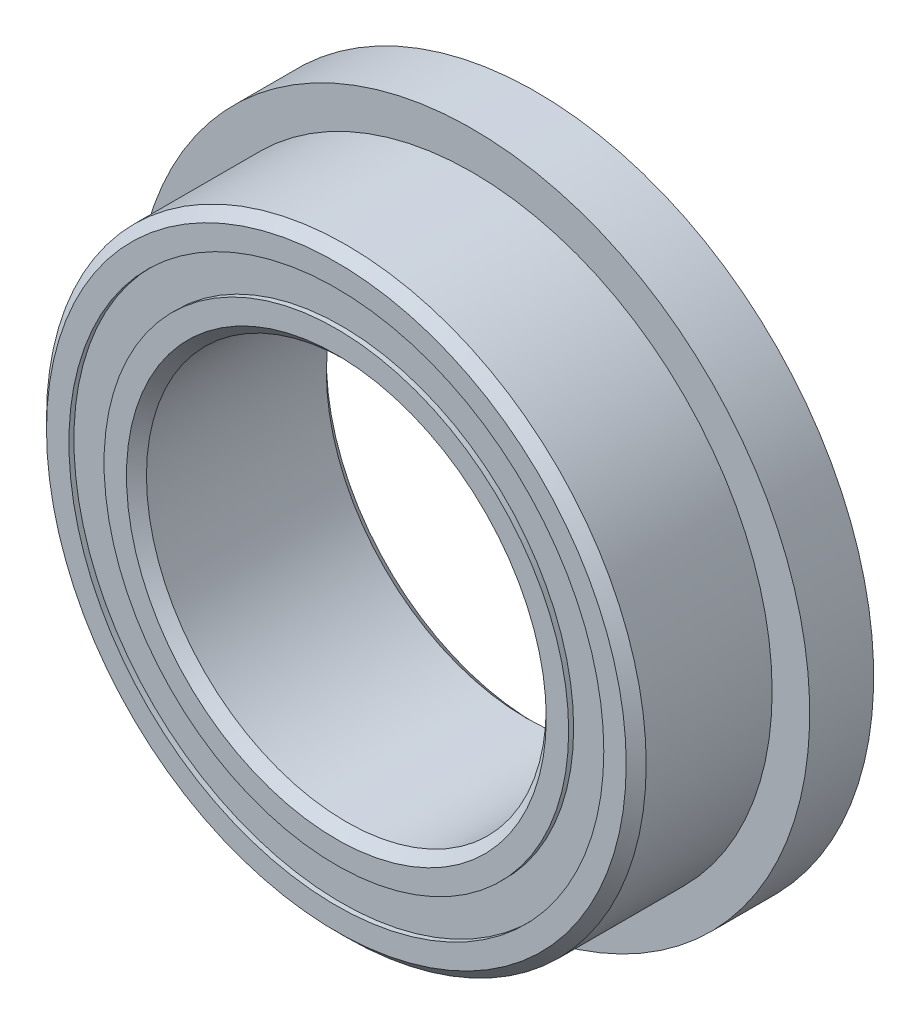
ISO-10303-21;
HEADER;
FILE_DESCRIPTION(('STEP AP214'),'2;1');
FILE_NAME('part.step','',(''),(''),'','','');
FILE_SCHEMA(('AUTOMOTIVE_DESIGN { 1 0 10303 214 1 1 1 1 }'));
ENDSEC;
DATA;
#1=APPLICATION_CONTEXT('core data for automotive mechanical design processes');
#2=APPLICATION_PROTOCOL_DEFINITION('international standard','automotive_design',2000,#1);
#3=PRODUCT_CONTEXT('',#1,'mechanical');
#4=PRODUCT('Part','Part','',(#3));
#5=PRODUCT_RELATED_PRODUCT_CATEGORY('part','',(#4));
#6=PRODUCT_DEFINITION_FORMATION('','',#4);
#7=PRODUCT_DEFINITION_CONTEXT('part definition',#1,'design');
#8=PRODUCT_DEFINITION('design','',#6,#7);
#9=PRODUCT_DEFINITION_SHAPE('','',#8);
#10=(LENGTH_UNIT() NAMED_UNIT(*) SI_UNIT(.MILLI.,.METRE.));
#11=(NAMED_UNIT(*) PLANE_ANGLE_UNIT() SI_UNIT($,.RADIAN.));
#12=(NAMED_UNIT(*) SI_UNIT($,.STERADIAN.) SOLID_ANGLE_UNIT());
#13=UNCERTAINTY_MEASURE_WITH_UNIT(LENGTH_MEASURE(1.E-05),#10,'distance_accuracy_value','');
#14=(GEOMETRIC_REPRESENTATION_CONTEXT(3) GLOBAL_UNCERTAINTY_ASSIGNED_CONTEXT((#13)) GLOBAL_UNIT_ASSIGNED_CONTEXT((#10,
#11,#12)) REPRESENTATION_CONTEXT('',''));
#15=CARTESIAN_POINT('',(0.,0.,0.));
#16=DIRECTION('',(0.,0.,1.));
#17=DIRECTION('',(1.,0.,0.));
#18=AXIS2_PLACEMENT_3D('',#15,#16,#17);
#19=CARTESIAN_POINT('',(0.,4.24787087912088,-1.508125));
#20=DIRECTION('',(0.,0.,1.));
#21=DIRECTION('',(1.,0.,0.));
#22=AXIS2_PLACEMENT_3D('',#19,#20,#21);
#23=PLANE('',#22);
#24=CARTESIAN_POINT('',(0.,0.,-1.508125));
#25=DIRECTION('',(0.,0.,1.));
#26=DIRECTION('',(1.,0.,0.));
#27=AXIS2_PLACEMENT_3D('',#24,#25,#26);
#28=CIRCLE('',#27,4.24787087912088);
#29=CARTESIAN_POINT('',(4.24787087912088,0.,-1.508125));
#30=VERTEX_POINT('',#29);
#31=EDGE_CURVE('E57',#30,#30,#28,.T.);
#32=ORIENTED_EDGE('',*,*,#31,.F.);
#33=EDGE_LOOP('',(#32));
#34=FACE_BOUND('',#33,.T.);
#35=CARTESIAN_POINT('',(0.,0.,-1.508125));
#36=DIRECTION('',(0.,0.,1.));
#37=DIRECTION('',(1.,0.,0.));
#38=AXIS2_PLACEMENT_3D('',#35,#36,#37);
#39=CIRCLE('',#38,3.68962912087912);
#40=CARTESIAN_POINT('',(3.68962912087912,0.,-1.508125));
#41=VERTEX_POINT('',#40);
#42=EDGE_CURVE('E11',#41,#41,#39,.T.);
#43=ORIENTED_EDGE('',*,*,#42,.T.);
#44=EDGE_LOOP('',(#43));
#45=FACE_BOUND('',#44,.T.);
#46=ADVANCED_FACE('F43',(#34,#45),#23,.F.);
#47=CARTESIAN_POINT('',(0.,0.,1.5875));
#48=DIRECTION('',(0.,0.,1.));
#49=DIRECTION('',(1.,0.,0.));
#50=AXIS2_PLACEMENT_3D('',#47,#48,#49);
#51=CYLINDRICAL_SURFACE('',#50,3.68962912087912);
#52=ORIENTED_EDGE('',*,*,#42,.F.);
#53=EDGE_LOOP('',(#52));
#54=FACE_BOUND('',#53,.T.);
#55=CARTESIAN_POINT('',(0.,0.,-0.758760243513405));
#56=DIRECTION('',(0.,0.,1.));
#57=DIRECTION('',(1.,0.,0.));
#58=AXIS2_PLACEMENT_3D('',#55,#56,#57);
#59=CIRCLE('',#58,3.68962912087912);
#60=CARTESIAN_POINT('',(3.68962912087912,0.,-0.758760243513405));
#61=VERTEX_POINT('',#60);
#62=EDGE_CURVE('E49',#61,#61,#59,.T.);
#63=ORIENTED_EDGE('',*,*,#62,.T.);
#64=EDGE_LOOP('',(#63));
#65=FACE_BOUND('',#64,.T.);
#66=ADVANCED_FACE('F66',(#54,#65),#51,.F.);
#67=CARTESIAN_POINT('',(0.,4.24787087912088,-0.758760243513405));
#68=DIRECTION('',(0.,0.,-1.));
#69=DIRECTION('',(-1.,0.,0.));
#70=AXIS2_PLACEMENT_3D('',#67,#68,#69);
#71=PLANE('',#70);
#72=ORIENTED_EDGE('',*,*,#62,.F.);
#73=EDGE_LOOP('',(#72));
#74=FACE_BOUND('',#73,.T.);
#75=CARTESIAN_POINT('',(0.,0.,-0.758760243513405));
#76=DIRECTION('',(0.,0.,1.));
#77=DIRECTION('',(1.,0.,0.));
#78=AXIS2_PLACEMENT_3D('',#75,#76,#77);
#79=CIRCLE('',#78,4.24787087912088);
#80=CARTESIAN_POINT('',(4.24787087912088,0.,-0.758760243513405));
#81=VERTEX_POINT('',#80);
#82=EDGE_CURVE('E53',#81,#81,#79,.T.);
#83=ORIENTED_EDGE('',*,*,#82,.T.);
#84=EDGE_LOOP('',(#83));
#85=FACE_BOUND('',#84,.T.);
#86=ADVANCED_FACE('F70',(#74,#85),#71,.F.);
#87=CARTESIAN_POINT('',(0.,0.,1.5875));
#88=DIRECTION('',(0.,0.,1.));
#89=DIRECTION('',(1.,0.,0.));
#90=AXIS2_PLACEMENT_3D('',#87,#88,#89);
#91=CYLINDRICAL_SURFACE('',#90,4.24787087912088);
#92=ORIENTED_EDGE('',*,*,#82,.F.);
#93=EDGE_LOOP('',(#92));
#94=FACE_BOUND('',#93,.T.);
#95=ORIENTED_EDGE('',*,*,#31,.T.);
#96=EDGE_LOOP('',(#95));
#97=FACE_BOUND('',#96,.T.);
#98=ADVANCED_FACE('F63',(#94,#97),#91,.T.);
#99=CLOSED_SHELL('',(#46,#66,#86,#98));
#100=MANIFOLD_SOLID_BREP('B2',#99);
#101=CARTESIAN_POINT('',(0.,4.24787087912088,1.508125));
#102=DIRECTION('',(0.,0.,-1.));
#103=DIRECTION('',(-1.,0.,0.));
#104=AXIS2_PLACEMENT_3D('',#101,#102,#103);
#105=PLANE('',#104);
#106=CARTESIAN_POINT('',(0.,0.,1.508125));
#107=DIRECTION('',(0.,0.,1.));
#108=DIRECTION('',(1.,0.,0.));
#109=AXIS2_PLACEMENT_3D('',#106,#107,#108);
#110=CIRCLE('',#109,3.68962912087912);
#111=CARTESIAN_POINT('',(3.68962912087912,0.,1.508125));
#112=VERTEX_POINT('',#111);
#113=EDGE_CURVE('E42',#112,#112,#110,.T.);
#114=ORIENTED_EDGE('',*,*,#113,.F.);
#115=EDGE_LOOP('',(#114));
#116=FACE_BOUND('',#115,.T.);
#117=CARTESIAN_POINT('',(0.,0.,1.508125));
#118=DIRECTION('',(0.,0.,1.));
#119=DIRECTION('',(1.,0.,0.));
#120=AXIS2_PLACEMENT_3D('',#117,#118,#119);
#121=CIRCLE('',#120,4.24787087912088);
#122=CARTESIAN_POINT('',(4.24787087912088,0.,1.508125));
#123=VERTEX_POINT('',#122);
#124=EDGE_CURVE('E124',#123,#123,#121,.T.);
#125=ORIENTED_EDGE('',*,*,#124,.T.);
#126=EDGE_LOOP('',(#125));
#127=FACE_BOUND('',#126,.T.);
#128=ADVANCED_FACE('F110',(#116,#127),#105,.F.);
#129=CARTESIAN_POINT('',(0.,0.,1.5875));
#130=DIRECTION('',(0.,0.,1.));
#131=DIRECTION('',(1.,0.,0.));
#132=AXIS2_PLACEMENT_3D('',#129,#130,#131);
#133=CYLINDRICAL_SURFACE('',#132,3.68962912087912);
#134=CARTESIAN_POINT('',(0.,0.,0.758760243513405));
#135=DIRECTION('',(0.,0.,1.));
#136=DIRECTION('',(1.,0.,0.));
#137=AXIS2_PLACEMENT_3D('',#134,#135,#136);
#138=CIRCLE('',#137,3.68962912087912);
#139=CARTESIAN_POINT('',(3.68962912087912,0.,0.758760243513405));
#140=VERTEX_POINT('',#139);
#141=EDGE_CURVE('E116',#140,#140,#138,.T.);
#142=ORIENTED_EDGE('',*,*,#141,.F.);
#143=EDGE_LOOP('',(#142));
#144=FACE_BOUND('',#143,.T.);
#145=ORIENTED_EDGE('',*,*,#113,.T.);
#146=EDGE_LOOP('',(#145));
#147=FACE_BOUND('',#146,.T.);
#148=ADVANCED_FACE('F139',(#144,#147),#133,.F.);
#149=CARTESIAN_POINT('',(0.,4.24787087912088,0.758760243513405));
#150=DIRECTION('',(0.,0.,1.));
#151=DIRECTION('',(1.,0.,0.));
#152=AXIS2_PLACEMENT_3D('',#149,#150,#151);
#153=PLANE('',#152);
#154=CARTESIAN_POINT('',(0.,0.,0.758760243513405));
#155=DIRECTION('',(0.,0.,1.));
#156=DIRECTION('',(1.,0.,0.));
#157=AXIS2_PLACEMENT_3D('',#154,#155,#156);
#158=CIRCLE('',#157,4.24787087912088);
#159=CARTESIAN_POINT('',(4.24787087912088,0.,0.758760243513405));
#160=VERTEX_POINT('',#159);
#161=EDGE_CURVE('E120',#160,#160,#158,.T.);
#162=ORIENTED_EDGE('',*,*,#161,.F.);
#163=EDGE_LOOP('',(#162));
#164=FACE_BOUND('',#163,.T.);
#165=ORIENTED_EDGE('',*,*,#141,.T.);
#166=EDGE_LOOP('',(#165));
#167=FACE_BOUND('',#166,.T.);
#168=ADVANCED_FACE('F134',(#164,#167),#153,.F.);
#169=CARTESIAN_POINT('',(0.,0.,1.5875));
#170=DIRECTION('',(0.,0.,1.));
#171=DIRECTION('',(1.,0.,0.));
#172=AXIS2_PLACEMENT_3D('',#169,#170,#171);
#173=CYLINDRICAL_SURFACE('',#172,4.24787087912088);
#174=ORIENTED_EDGE('',*,*,#124,.F.);
#175=EDGE_LOOP('',(#174));
#176=FACE_BOUND('',#175,.T.);
#177=ORIENTED_EDGE('',*,*,#161,.T.);
#178=EDGE_LOOP('',(#177));
#179=FACE_BOUND('',#178,.T.);
#180=ADVANCED_FACE('F131',(#176,#179),#173,.T.);
#181=CLOSED_SHELL('',(#128,#148,#168,#180));
#182=MANIFOLD_SOLID_BREP('B6',#181);
#183=CARTESIAN_POINT('',(-1.98437499999996,3.43703832126952,0.));
#184=DIRECTION('',(0.,0.,1.));
#185=DIRECTION('',(-0.499999999999989,0.866025403784445,0.));
#186=AXIS2_PLACEMENT_3D('',#183,#184,#185);
#187=SPHERICAL_SURFACE('',#186,0.758760243513405);
#188=CARTESIAN_POINT('',(-1.98437499999996,3.43703832126952,0.758760243513405));
#189=VERTEX_POINT('',#188);
#190=VERTEX_LOOP('',#189);
#191=FACE_BOUND('',#190,.T.);
#192=ADVANCED_FACE('F177',(#191),#187,.T.);
#193=CLOSED_SHELL('',(#192));
#194=MANIFOLD_SOLID_BREP('B37',#193);
#195=CARTESIAN_POINT('',(-3.43703832126947,1.98437500000004,0.));
#196=DIRECTION('',(0.,0.,1.));
#197=DIRECTION('',(-0.866025403784433,0.50000000000001,0.));
#198=AXIS2_PLACEMENT_3D('',#195,#196,#197);
#199=SPHERICAL_SURFACE('',#198,0.758760243513405);
#200=CARTESIAN_POINT('',(-3.43703832126947,1.98437500000004,0.758760243513405));
#201=VERTEX_POINT('',#200);
#202=VERTEX_LOOP('',#201);
#203=FACE_BOUND('',#202,.T.);
#204=ADVANCED_FACE('F197',(#203),#199,.T.);
#205=CLOSED_SHELL('',(#204));
#206=MANIFOLD_SOLID_BREP('B106',#205);
#207=CARTESIAN_POINT('',(-3.96875,0.,0.));
#208=DIRECTION('',(0.,0.,1.));
#209=DIRECTION('',(-1.,0.,0.));
#210=AXIS2_PLACEMENT_3D('',#207,#208,#209);
#211=SPHERICAL_SURFACE('',#210,0.758760243513405);
#212=CARTESIAN_POINT('',(-3.96875,0.,0.758760243513405));
#213=VERTEX_POINT('',#212);
#214=VERTEX_LOOP('',#213);
#215=FACE_BOUND('',#214,.T.);
#216=ADVANCED_FACE('F217',(#215),#211,.T.);
#217=CLOSED_SHELL('',(#216));
#218=MANIFOLD_SOLID_BREP('B173',#217);
#219=CARTESIAN_POINT('',(-3.43703832126951,-1.98437499999997,0.));
#220=DIRECTION('',(0.,0.,1.));
#221=DIRECTION('',(-0.866025403784443,-0.499999999999992,0.));
#222=AXIS2_PLACEMENT_3D('',#219,#220,#221);
#223=SPHERICAL_SURFACE('',#222,0.758760243513405);
#224=CARTESIAN_POINT('',(-3.43703832126951,-1.98437499999997,0.758760243513405));
#225=VERTEX_POINT('',#224);
#226=VERTEX_LOOP('',#225);
#227=FACE_BOUND('',#226,.T.);
#228=ADVANCED_FACE('F237',(#227),#223,.T.);
#229=CLOSED_SHELL('',(#228));
#230=MANIFOLD_SOLID_BREP('B193',#229);
#231=CARTESIAN_POINT('',(-1.98437500000003,-3.43703832126947,0.));
#232=DIRECTION('',(0.,0.,1.));
#233=DIRECTION('',(-0.500000000000007,-0.866025403784435,0.));
#234=AXIS2_PLACEMENT_3D('',#231,#232,#233);
#235=SPHERICAL_SURFACE('',#234,0.758760243513405);
#236=CARTESIAN_POINT('',(-1.98437500000003,-3.43703832126947,0.758760243513405));
#237=VERTEX_POINT('',#236);
#238=VERTEX_LOOP('',#237);
#239=FACE_BOUND('',#238,.T.);
#240=ADVANCED_FACE('F257',(#239),#235,.T.);
#241=CLOSED_SHELL('',(#240));
#242=MANIFOLD_SOLID_BREP('B213',#241);
#243=CARTESIAN_POINT('',(0.,-3.96875,0.));
#244=DIRECTION('',(0.,0.,1.));
#245=DIRECTION('',(0.,-1.,0.));
#246=AXIS2_PLACEMENT_3D('',#243,#244,#245);
#247=SPHERICAL_SURFACE('',#246,0.758760243513405);
#248=CARTESIAN_POINT('',(0.,-3.96875,0.758760243513405));
#249=VERTEX_POINT('',#248);
#250=VERTEX_LOOP('',#249);
#251=FACE_BOUND('',#250,.T.);
#252=ADVANCED_FACE('F277',(#251),#247,.T.);
#253=CLOSED_SHELL('',(#252));
#254=MANIFOLD_SOLID_BREP('B233',#253);
#255=CARTESIAN_POINT('',(1.98437499999998,-3.4370383212695,0.));
#256=DIRECTION('',(0.,0.,1.));
#257=DIRECTION('',(0.499999999999995,-0.866025403784442,0.));
#258=AXIS2_PLACEMENT_3D('',#255,#256,#257);
#259=SPHERICAL_SURFACE('',#258,0.758760243513405);
#260=CARTESIAN_POINT('',(1.98437499999998,-3.4370383212695,0.758760243513405));
#261=VERTEX_POINT('',#260);
#262=VERTEX_LOOP('',#261);
#263=FACE_BOUND('',#262,.T.);
#264=ADVANCED_FACE('F297',(#263),#259,.T.);
#265=CLOSED_SHELL('',(#264));
#266=MANIFOLD_SOLID_BREP('B253',#265);
#267=CARTESIAN_POINT('',(3.43703832126948,-1.98437500000002,0.));
#268=DIRECTION('',(0.,0.,1.));
#269=DIRECTION('',(0.866025403784436,-0.500000000000004,0.));
#270=AXIS2_PLACEMENT_3D('',#267,#268,#269);
#271=SPHERICAL_SURFACE('',#270,0.758760243513405);
#272=CARTESIAN_POINT('',(3.43703832126948,-1.98437500000002,0.758760243513405));
#273=VERTEX_POINT('',#272);
#274=VERTEX_LOOP('',#273);
#275=FACE_BOUND('',#274,.T.);
#276=ADVANCED_FACE('F317',(#275),#271,.T.);
#277=CLOSED_SHELL('',(#276));
#278=MANIFOLD_SOLID_BREP('B273',#277);
#279=CARTESIAN_POINT('',(3.96875,0.,0.));
#280=DIRECTION('',(0.,0.,1.));
#281=DIRECTION('',(1.,0.,0.));
#282=AXIS2_PLACEMENT_3D('',#279,#280,#281);
#283=SPHERICAL_SURFACE('',#282,0.758760243513405);
#284=CARTESIAN_POINT('',(3.96875,0.,0.758760243513405));
#285=VERTEX_POINT('',#284);
#286=VERTEX_LOOP('',#285);
#287=FACE_BOUND('',#286,.T.);
#288=ADVANCED_FACE('F337',(#287),#283,.T.);
#289=CLOSED_SHELL('',(#288));
#290=MANIFOLD_SOLID_BREP('B293',#289);
#291=CARTESIAN_POINT('',(3.4370383212695,1.98437499999999,0.));
#292=DIRECTION('',(0.,0.,1.));
#293=DIRECTION('',(0.86602540378444,0.499999999999998,0.));
#294=AXIS2_PLACEMENT_3D('',#291,#292,#293);
#295=SPHERICAL_SURFACE('',#294,0.758760243513405);
#296=CARTESIAN_POINT('',(3.4370383212695,1.98437499999999,0.758760243513405));
#297=VERTEX_POINT('',#296);
#298=VERTEX_LOOP('',#297);
#299=FACE_BOUND('',#298,.T.);
#300=ADVANCED_FACE('F357',(#299),#295,.T.);
#301=CLOSED_SHELL('',(#300));
#302=MANIFOLD_SOLID_BREP('B313',#301);
#303=CARTESIAN_POINT('',(1.984375,3.43703832126949,0.));
#304=DIRECTION('',(0.,0.,1.));
#305=DIRECTION('',(0.500000000000001,0.866025403784438,0.));
#306=AXIS2_PLACEMENT_3D('',#303,#304,#305);
#307=SPHERICAL_SURFACE('',#306,0.758760243513405);
#308=CARTESIAN_POINT('',(1.984375,3.43703832126949,0.758760243513405));
#309=VERTEX_POINT('',#308);
#310=VERTEX_LOOP('',#309);
#311=FACE_BOUND('',#310,.T.);
#312=ADVANCED_FACE('F377',(#311),#307,.T.);
#313=CLOSED_SHELL('',(#312));
#314=MANIFOLD_SOLID_BREP('B333',#313);
#315=CARTESIAN_POINT('',(0.,3.96875,0.));
#316=DIRECTION('',(0.,0.,1.));
#317=DIRECTION('',(0.,1.,0.));
#318=AXIS2_PLACEMENT_3D('',#315,#316,#317);
#319=SPHERICAL_SURFACE('',#318,0.758760243513405);
#320=CARTESIAN_POINT('',(0.,3.96875,0.758760243513405));
#321=VERTEX_POINT('',#320);
#322=VERTEX_LOOP('',#321);
#323=FACE_BOUND('',#322,.T.);
#324=ADVANCED_FACE('F399',(#323),#319,.T.);
#325=CLOSED_SHELL('',(#324));
#326=MANIFOLD_SOLID_BREP('B353',#325);
#327=CARTESIAN_POINT('',(0.,3.68962912087912,1.5875));
#328=DIRECTION('',(0.,0.,-1.));
#329=DIRECTION('',(-1.,0.,0.));
#330=AXIS2_PLACEMENT_3D('',#327,#328,#329);
#331=PLANE('',#330);
#332=CARTESIAN_POINT('',(0.,0.,1.5875));
#333=DIRECTION('',(0.,0.,1.));
#334=DIRECTION('',(1.,0.,0.));
#335=AXIS2_PLACEMENT_3D('',#332,#333,#334);
#336=CIRCLE('',#335,3.33375);
#337=CARTESIAN_POINT('',(3.33375,0.,1.5875));
#338=VERTEX_POINT('',#337);
#339=EDGE_CURVE('E446',#338,#338,#336,.T.);
#340=ORIENTED_EDGE('',*,*,#339,.F.);
#341=EDGE_LOOP('',(#340));
#342=FACE_BOUND('',#341,.T.);
#343=CARTESIAN_POINT('',(0.,0.,1.5875));
#344=DIRECTION('',(0.,0.,1.));
#345=DIRECTION('',(1.,0.,0.));
#346=AXIS2_PLACEMENT_3D('',#343,#344,#345);
#347=CIRCLE('',#346,3.68962912087912);
#348=CARTESIAN_POINT('',(3.68962912087912,0.,1.5875));
#349=VERTEX_POINT('',#348);
#350=EDGE_CURVE('E398',#349,#349,#347,.T.);
#351=ORIENTED_EDGE('',*,*,#350,.T.);
#352=EDGE_LOOP('',(#351));
#353=FACE_BOUND('',#352,.T.);
#354=ADVANCED_FACE('F418',(#342,#353),#331,.F.);
#355=CARTESIAN_POINT('',(0.,0.,1.5875));
#356=DIRECTION('',(0.,0.,1.));
#357=DIRECTION('',(1.,0.,0.));
#358=AXIS2_PLACEMENT_3D('',#355,#356,#357);
#359=CYLINDRICAL_SURFACE('',#358,3.68962912087912);
#360=ORIENTED_EDGE('',*,*,#350,.F.);
#361=EDGE_LOOP('',(#360));
#362=FACE_BOUND('',#361,.T.);
#363=CARTESIAN_POINT('',(0.,0.,0.705555555555555));
#364=DIRECTION('',(0.,0.,1.));
#365=DIRECTION('',(1.,0.,0.));
#366=AXIS2_PLACEMENT_3D('',#363,#364,#365);
#367=CIRCLE('',#366,3.68962912087912);
#368=CARTESIAN_POINT('',(3.68962912087912,0.,0.705555555555555));
#369=VERTEX_POINT('',#368);
#370=EDGE_CURVE('E424',#369,#369,#367,.T.);
#371=ORIENTED_EDGE('',*,*,#370,.T.);
#372=EDGE_LOOP('',(#371));
#373=FACE_BOUND('',#372,.T.);
#374=ADVANCED_FACE('F453',(#362,#373),#359,.T.);
#375=CARTESIAN_POINT('',(0.,0.,0.));
#376=DIRECTION('',(0.,0.,1.));
#377=DIRECTION('',(1.,0.,0.));
#378=AXIS2_PLACEMENT_3D('',#375,#376,#377);
#379=TOROIDAL_SURFACE('',#378,3.96875,0.758760243513404);
#380=ORIENTED_EDGE('',*,*,#370,.F.);
#381=EDGE_LOOP('',(#380));
#382=FACE_BOUND('',#381,.T.);
#383=CARTESIAN_POINT('',(0.,0.,-0.705555555555556));
#384=DIRECTION('',(0.,0.,1.));
#385=DIRECTION('',(1.,0.,0.));
#386=AXIS2_PLACEMENT_3D('',#383,#384,#385);
#387=CIRCLE('',#386,3.68962912087912);
#388=CARTESIAN_POINT('',(3.68962912087912,0.,-0.705555555555556));
#389=VERTEX_POINT('',#388);
#390=EDGE_CURVE('E428',#389,#389,#387,.T.);
#391=ORIENTED_EDGE('',*,*,#390,.T.);
#392=EDGE_LOOP('',(#391));
#393=FACE_BOUND('',#392,.T.);
#394=ADVANCED_FACE('F457',(#382,#393),#379,.F.);
#395=CARTESIAN_POINT('',(0.,0.,1.5875));
#396=DIRECTION('',(0.,0.,1.));
#397=DIRECTION('',(1.,0.,0.));
#398=AXIS2_PLACEMENT_3D('',#395,#396,#397);
#399=CYLINDRICAL_SURFACE('',#398,3.68962912087912);
#400=ORIENTED_EDGE('',*,*,#390,.F.);
#401=EDGE_LOOP('',(#400));
#402=FACE_BOUND('',#401,.T.);
#403=CARTESIAN_POINT('',(0.,0.,-1.5875));
#404=DIRECTION('',(0.,0.,1.));
#405=DIRECTION('',(1.,0.,0.));
#406=AXIS2_PLACEMENT_3D('',#403,#404,#405);
#407=CIRCLE('',#406,3.68962912087912);
#408=CARTESIAN_POINT('',(3.68962912087912,0.,-1.5875));
#409=VERTEX_POINT('',#408);
#410=EDGE_CURVE('E432',#409,#409,#407,.T.);
#411=ORIENTED_EDGE('',*,*,#410,.T.);
#412=EDGE_LOOP('',(#411));
#413=FACE_BOUND('',#412,.T.);
#414=ADVANCED_FACE('F462',(#402,#413),#399,.T.);
#415=CARTESIAN_POINT('',(0.,3.33375,-1.5875));
#416=DIRECTION('',(0.,0.,1.));
#417=DIRECTION('',(1.,0.,0.));
#418=AXIS2_PLACEMENT_3D('',#415,#416,#417);
#419=PLANE('',#418);
#420=ORIENTED_EDGE('',*,*,#410,.F.);
#421=EDGE_LOOP('',(#420));
#422=FACE_BOUND('',#421,.T.);
#423=CARTESIAN_POINT('',(0.,0.,-1.5875));
#424=DIRECTION('',(0.,0.,1.));
#425=DIRECTION('',(1.,0.,0.));
#426=AXIS2_PLACEMENT_3D('',#423,#424,#425);
#427=CIRCLE('',#426,3.33375);
#428=CARTESIAN_POINT('',(3.33375,0.,-1.5875));
#429=VERTEX_POINT('',#428);
#430=EDGE_CURVE('E437',#429,#429,#427,.T.);
#431=ORIENTED_EDGE('',*,*,#430,.T.);
#432=EDGE_LOOP('',(#431));
#433=FACE_BOUND('',#432,.T.);
#434=ADVANCED_FACE('F468',(#422,#433),#419,.F.);
#435=CARTESIAN_POINT('',(0.,0.,-1.42875));
#436=DIRECTION('',(0.,0.,-1.));
#437=DIRECTION('',(-1.,0.,0.));
#438=AXIS2_PLACEMENT_3D('',#435,#436,#437);
#439=CONICAL_SURFACE('',#438,3.175,0.785398163397448);
#440=ORIENTED_EDGE('',*,*,#430,.F.);
#441=EDGE_LOOP('',(#440));
#442=FACE_BOUND('',#441,.T.);
#443=CARTESIAN_POINT('',(0.,0.,-1.42875));
#444=DIRECTION('',(0.,0.,1.));
#445=DIRECTION('',(1.,0.,0.));
#446=AXIS2_PLACEMENT_3D('',#443,#444,#445);
#447=CIRCLE('',#446,3.175);
#448=CARTESIAN_POINT('',(3.175,0.,-1.42875));
#449=VERTEX_POINT('',#448);
#450=EDGE_CURVE('E440',#449,#449,#447,.T.);
#451=ORIENTED_EDGE('',*,*,#450,.T.);
#452=EDGE_LOOP('',(#451));
#453=FACE_BOUND('',#452,.T.);
#454=ADVANCED_FACE('F472',(#442,#453),#439,.F.);
#455=CARTESIAN_POINT('',(0.,0.,1.5875));
#456=DIRECTION('',(0.,0.,1.));
#457=DIRECTION('',(1.,0.,0.));
#458=AXIS2_PLACEMENT_3D('',#455,#456,#457);
#459=CYLINDRICAL_SURFACE('',#458,3.175);
#460=ORIENTED_EDGE('',*,*,#450,.F.);
#461=EDGE_LOOP('',(#460));
#462=FACE_BOUND('',#461,.T.);
#463=CARTESIAN_POINT('',(0.,0.,1.42875));
#464=DIRECTION('',(0.,0.,1.));
#465=DIRECTION('',(1.,0.,0.));
#466=AXIS2_PLACEMENT_3D('',#463,#464,#465);
#467=CIRCLE('',#466,3.175);
#468=CARTESIAN_POINT('',(3.175,0.,1.42875));
#469=VERTEX_POINT('',#468);
#470=EDGE_CURVE('E443',#469,#469,#467,.T.);
#471=ORIENTED_EDGE('',*,*,#470,.T.);
#472=EDGE_LOOP('',(#471));
#473=FACE_BOUND('',#472,.T.);
#474=ADVANCED_FACE('F476',(#462,#473),#459,.F.);
#475=CARTESIAN_POINT('',(0.,0.,1.5875));
#476=DIRECTION('',(0.,0.,1.));
#477=DIRECTION('',(1.,0.,0.));
#478=AXIS2_PLACEMENT_3D('',#475,#476,#477);
#479=CONICAL_SURFACE('',#478,3.33375,0.785398163397448);
#480=ORIENTED_EDGE('',*,*,#470,.F.);
#481=EDGE_LOOP('',(#480));
#482=FACE_BOUND('',#481,.T.);
#483=ORIENTED_EDGE('',*,*,#339,.T.);
#484=EDGE_LOOP('',(#483));
#485=FACE_BOUND('',#484,.T.);
#486=ADVANCED_FACE('F450',(#482,#485),#479,.F.);
#487=CLOSED_SHELL('',(#354,#374,#394,#414,#434,#454,#474,#486));
#488=MANIFOLD_SOLID_BREP('B373',#487);
#489=CARTESIAN_POINT('',(0.,0.,1.42875));
#490=DIRECTION('',(0.,0.,-1.));
#491=DIRECTION('',(-1.,0.,0.));
#492=AXIS2_PLACEMENT_3D('',#489,#490,#491);
#493=CONICAL_SURFACE('',#492,4.7625,0.785398163397448);
#494=CARTESIAN_POINT('',(0.,0.,1.5875));
#495=DIRECTION('',(0.,0.,1.));
#496=DIRECTION('',(1.,0.,0.));
#497=AXIS2_PLACEMENT_3D('',#494,#495,#496);
#498=CIRCLE('',#497,4.60375);
#499=CARTESIAN_POINT('',(4.60375,0.,1.5875));
#500=VERTEX_POINT('',#499);
#501=EDGE_CURVE('E558',#500,#500,#498,.T.);
#502=ORIENTED_EDGE('',*,*,#501,.F.);
#503=EDGE_LOOP('',(#502));
#504=FACE_BOUND('',#503,.T.);
#505=CARTESIAN_POINT('',(0.,0.,1.42875));
#506=DIRECTION('',(0.,0.,1.));
#507=DIRECTION('',(1.,0.,0.));
#508=AXIS2_PLACEMENT_3D('',#505,#506,#507);
#509=CIRCLE('',#508,4.7625);
#510=CARTESIAN_POINT('',(4.7625,0.,1.42875));
#511=VERTEX_POINT('',#510);
#512=EDGE_CURVE('E417',#511,#511,#509,.T.);
#513=ORIENTED_EDGE('',*,*,#512,.T.);
#514=EDGE_LOOP('',(#513));
#515=FACE_BOUND('',#514,.T.);
#516=ADVANCED_FACE('F539',(#504,#515),#493,.T.);
#517=CARTESIAN_POINT('',(0.,0.,1.5875));
#518=DIRECTION('',(0.,0.,1.));
#519=DIRECTION('',(1.,0.,0.));
#520=AXIS2_PLACEMENT_3D('',#517,#518,#519);
#521=CYLINDRICAL_SURFACE('',#520,4.7625);
#522=CARTESIAN_POINT('',(0.,0.,-0.5715));
#523=DIRECTION('',(0.,0.,1.));
#524=DIRECTION('',(1.,0.,0.));
#525=AXIS2_PLACEMENT_3D('',#522,#523,#524);
#526=CIRCLE('',#525,4.7625);
#527=CARTESIAN_POINT('',(4.7625,0.,-0.5715));
#528=VERTEX_POINT('',#527);
#529=EDGE_CURVE('E561',#528,#528,#526,.T.);
#530=ORIENTED_EDGE('',*,*,#529,.T.);
#531=EDGE_LOOP('',(#530));
#532=FACE_BOUND('',#531,.T.);
#533=ORIENTED_EDGE('',*,*,#512,.F.);
#534=EDGE_LOOP('',(#533));
#535=FACE_BOUND('',#534,.T.);
#536=ADVANCED_FACE('F595',(#532,#535),#521,.T.);
#537=CARTESIAN_POINT('',(0.,0.,0.));
#538=DIRECTION('',(0.,0.,1.));
#539=DIRECTION('',(1.,0.,0.));
#540=AXIS2_PLACEMENT_3D('',#537,#538,#539);
#541=TOROIDAL_SURFACE('',#540,3.96875,0.758760243513405);
#542=CARTESIAN_POINT('',(0.,0.,-0.5715));
#543=DIRECTION('',(0.,0.,1.));
#544=DIRECTION('',(1.,0.,0.));
#545=AXIS2_PLACEMENT_3D('',#542,#543,#544);
#546=CIRCLE('',#545,4.46785405441804);
#547=CARTESIAN_POINT('',(4.46785405441804,0.,-0.5715));
#548=VERTEX_POINT('',#547);
#549=EDGE_CURVE('E542',#548,#548,#546,.F.);
#550=ORIENTED_EDGE('',*,*,#549,.T.);
#551=EDGE_LOOP('',(#550));
#552=FACE_BOUND('',#551,.T.);
#553=CARTESIAN_POINT('',(0.,0.,0.705555555555555));
#554=DIRECTION('',(0.,0.,1.));
#555=DIRECTION('',(1.,0.,0.));
#556=AXIS2_PLACEMENT_3D('',#553,#554,#555);
#557=CIRCLE('',#556,4.24787087912088);
#558=CARTESIAN_POINT('',(4.24787087912088,0.,0.705555555555555));
#559=VERTEX_POINT('',#558);
#560=EDGE_CURVE('E550',#559,#559,#557,.T.);
#561=ORIENTED_EDGE('',*,*,#560,.T.);
#562=EDGE_LOOP('',(#561));
#563=FACE_BOUND('',#562,.T.);
#564=ADVANCED_FACE('F600',(#552,#563),#541,.F.);
#565=CARTESIAN_POINT('',(0.,0.,1.5875));
#566=DIRECTION('',(0.,0.,1.));
#567=DIRECTION('',(1.,0.,0.));
#568=AXIS2_PLACEMENT_3D('',#565,#566,#567);
#569=CYLINDRICAL_SURFACE('',#568,4.24787087912088);
#570=ORIENTED_EDGE('',*,*,#560,.F.);
#571=EDGE_LOOP('',(#570));
#572=FACE_BOUND('',#571,.T.);
#573=CARTESIAN_POINT('',(0.,0.,1.5875));
#574=DIRECTION('',(0.,0.,1.));
#575=DIRECTION('',(1.,0.,0.));
#576=AXIS2_PLACEMENT_3D('',#573,#574,#575);
#577=CIRCLE('',#576,4.24787087912088);
#578=CARTESIAN_POINT('',(4.24787087912088,0.,1.5875));
#579=VERTEX_POINT('',#578);
#580=EDGE_CURVE('E555',#579,#579,#577,.T.);
#581=ORIENTED_EDGE('',*,*,#580,.T.);
#582=EDGE_LOOP('',(#581));
#583=FACE_BOUND('',#582,.T.);
#584=ADVANCED_FACE('F606',(#572,#583),#569,.F.);
#585=CARTESIAN_POINT('',(0.,4.60375,1.5875));
#586=DIRECTION('',(0.,0.,-1.));
#587=DIRECTION('',(-1.,0.,0.));
#588=AXIS2_PLACEMENT_3D('',#585,#586,#587);
#589=PLANE('',#588);
#590=ORIENTED_EDGE('',*,*,#580,.F.);
#591=EDGE_LOOP('',(#590));
#592=FACE_BOUND('',#591,.T.);
#593=ORIENTED_EDGE('',*,*,#501,.T.);
#594=EDGE_LOOP('',(#593));
#595=FACE_BOUND('',#594,.T.);
#596=ADVANCED_FACE('F604',(#592,#595),#589,.F.);
#597=CARTESIAN_POINT('',(0.,4.24787087912088,-0.5715));
#598=DIRECTION('',(0.,0.,1.));
#599=DIRECTION('',(1.,0.,0.));
#600=AXIS2_PLACEMENT_3D('',#597,#598,#599);
#601=PLANE('',#600);
#602=CARTESIAN_POINT('',(0.,0.,-0.5715));
#603=DIRECTION('',(0.,0.,-1.));
#604=DIRECTION('',(-1.,0.,0.));
#605=AXIS2_PLACEMENT_3D('',#602,#603,#604);
#606=CIRCLE('',#605,4.24787087912088);
#607=CARTESIAN_POINT('',(-4.24787087912088,0.,-0.5715));
#608=VERTEX_POINT('',#607);
#609=EDGE_CURVE('E570',#608,#608,#606,.T.);
#610=ORIENTED_EDGE('',*,*,#609,.T.);
#611=EDGE_LOOP('',(#610));
#612=FACE_BOUND('',#611,.T.);
#613=ORIENTED_EDGE('',*,*,#549,.F.);
#614=EDGE_LOOP('',(#613));
#615=FACE_BOUND('',#614,.T.);
#616=ADVANCED_FACE('F574',(#612,#615),#601,.T.);
#617=CARTESIAN_POINT('',(0.,0.,-0.5715));
#618=DIRECTION('',(0.,0.,-1.));
#619=DIRECTION('',(-1.,0.,0.));
#620=AXIS2_PLACEMENT_3D('',#617,#618,#619);
#621=CIRCLE('',#620,5.3594);
#622=CARTESIAN_POINT('',(-5.3594,0.,-0.5715));
#623=VERTEX_POINT('',#622);
#624=EDGE_CURVE('E567',#623,#623,#621,.T.);
#625=ORIENTED_EDGE('',*,*,#624,.F.);
#626=EDGE_LOOP('',(#625));
#627=FACE_BOUND('',#626,.T.);
#628=ORIENTED_EDGE('',*,*,#529,.F.);
#629=EDGE_LOOP('',(#628));
#630=FACE_BOUND('',#629,.T.);
#631=ADVANCED_FACE('F589',(#627,#630),#601,.T.);
#632=CARTESIAN_POINT('',(0.,0.,-1.5875));
#633=DIRECTION('',(0.,0.,-1.));
#634=DIRECTION('',(-1.,0.,0.));
#635=AXIS2_PLACEMENT_3D('',#632,#633,#634);
#636=CYLINDRICAL_SURFACE('',#635,5.3594);
#637=ORIENTED_EDGE('',*,*,#624,.T.);
#638=EDGE_LOOP('',(#637));
#639=FACE_BOUND('',#638,.T.);
#640=CARTESIAN_POINT('',(0.,0.,-1.5875));
#641=DIRECTION('',(0.,0.,-1.));
#642=DIRECTION('',(-1.,0.,0.));
#643=AXIS2_PLACEMENT_3D('',#640,#641,#642);
#644=CIRCLE('',#643,5.3594);
#645=CARTESIAN_POINT('',(-5.3594,0.,-1.5875));
#646=VERTEX_POINT('',#645);
#647=EDGE_CURVE('E564',#646,#646,#644,.T.);
#648=ORIENTED_EDGE('',*,*,#647,.F.);
#649=EDGE_LOOP('',(#648));
#650=FACE_BOUND('',#649,.T.);
#651=ADVANCED_FACE('F580',(#639,#650),#636,.T.);
#652=CARTESIAN_POINT('',(0.,0.,1.5875));
#653=DIRECTION('',(0.,0.,1.));
#654=DIRECTION('',(1.,0.,0.));
#655=AXIS2_PLACEMENT_3D('',#652,#653,#654);
#656=CYLINDRICAL_SURFACE('',#655,4.24787087912088);
#657=CARTESIAN_POINT('',(0.,0.,-1.5875));
#658=DIRECTION('',(0.,0.,1.));
#659=DIRECTION('',(1.,0.,0.));
#660=AXIS2_PLACEMENT_3D('',#657,#658,#659);
#661=CIRCLE('',#660,4.24787087912088);
#662=CARTESIAN_POINT('',(4.24787087912088,0.,-1.5875));
#663=VERTEX_POINT('',#662);
#664=EDGE_CURVE('E546',#663,#663,#661,.T.);
#665=ORIENTED_EDGE('',*,*,#664,.F.);
#666=EDGE_LOOP('',(#665));
#667=FACE_BOUND('',#666,.T.);
#668=ORIENTED_EDGE('',*,*,#609,.F.);
#669=EDGE_LOOP('',(#668));
#670=FACE_BOUND('',#669,.T.);
#671=ADVANCED_FACE('F577',(#667,#670),#656,.F.);
#672=CARTESIAN_POINT('',(0.,4.60375,-1.5875));
#673=DIRECTION('',(0.,0.,1.));
#674=DIRECTION('',(1.,0.,0.));
#675=AXIS2_PLACEMENT_3D('',#672,#673,#674);
#676=PLANE('',#675);
#677=ORIENTED_EDGE('',*,*,#664,.T.);
#678=EDGE_LOOP('',(#677));
#679=FACE_BOUND('',#678,.T.);
#680=ORIENTED_EDGE('',*,*,#647,.T.);
#681=EDGE_LOOP('',(#680));
#682=FACE_BOUND('',#681,.T.);
#683=ADVANCED_FACE('F579',(#679,#682),#676,.F.);
#684=CLOSED_SHELL('',(#516,#536,#564,#584,#596,#616,#631,#651,#671,#683));
#685=MANIFOLD_SOLID_BREP('B393',#684);
#686=ADVANCED_BREP_SHAPE_REPRESENTATION('',(#18,#100,#182,#194,#206,#218,#230,#242,#254,#266,
#278,#290,#302,#314,#326,#488,#685),#14);
#687=SHAPE_DEFINITION_REPRESENTATION(#9,#686);
ENDSEC;
END-ISO-10303-21;
